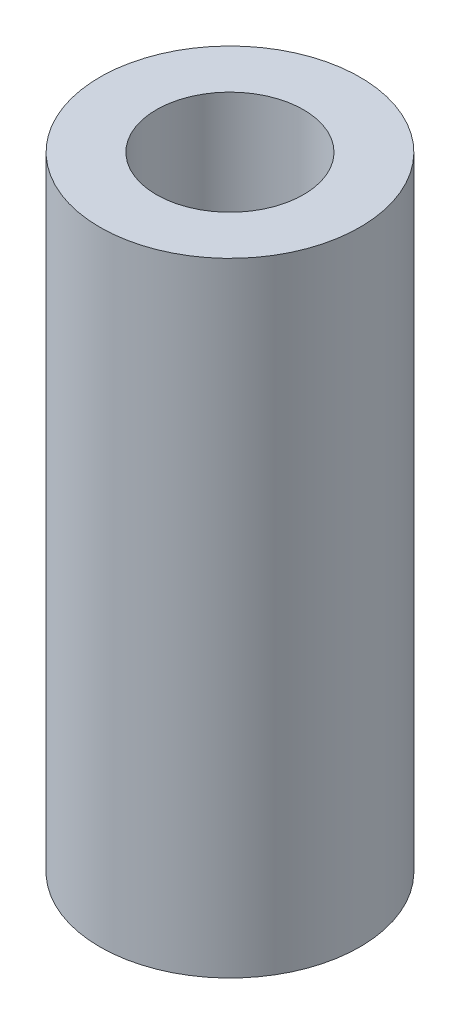
ISO-10303-21;
HEADER;
FILE_DESCRIPTION(('STEP AP214'),'2;1');
FILE_NAME('part.step','',(''),(''),'','','');
FILE_SCHEMA(('AUTOMOTIVE_DESIGN { 1 0 10303 214 1 1 1 1 }'));
ENDSEC;
DATA;
#1=APPLICATION_CONTEXT('core data for automotive mechanical design processes');
#2=APPLICATION_PROTOCOL_DEFINITION('international standard','automotive_design',2000,#1);
#3=PRODUCT_CONTEXT('',#1,'mechanical');
#4=PRODUCT('Part','Part','',(#3));
#5=PRODUCT_RELATED_PRODUCT_CATEGORY('part','',(#4));
#6=PRODUCT_DEFINITION_FORMATION('','',#4);
#7=PRODUCT_DEFINITION_CONTEXT('part definition',#1,'design');
#8=PRODUCT_DEFINITION('design','',#6,#7);
#9=PRODUCT_DEFINITION_SHAPE('','',#8);
#10=(LENGTH_UNIT() NAMED_UNIT(*) SI_UNIT(.MILLI.,.METRE.));
#11=(NAMED_UNIT(*) PLANE_ANGLE_UNIT() SI_UNIT($,.RADIAN.));
#12=(NAMED_UNIT(*) SI_UNIT($,.STERADIAN.) SOLID_ANGLE_UNIT());
#13=UNCERTAINTY_MEASURE_WITH_UNIT(LENGTH_MEASURE(1.E-05),#10,'distance_accuracy_value','');
#14=(GEOMETRIC_REPRESENTATION_CONTEXT(3) GLOBAL_UNCERTAINTY_ASSIGNED_CONTEXT((#13)) GLOBAL_UNIT_ASSIGNED_CONTEXT((#10,
#11,#12)) REPRESENTATION_CONTEXT('',''));
#15=CARTESIAN_POINT('',(0.,0.,0.));
#16=DIRECTION('',(0.,0.,1.));
#17=DIRECTION('',(1.,0.,0.));
#18=AXIS2_PLACEMENT_3D('',#15,#16,#17);
#19=CARTESIAN_POINT('',(0.,9.525,0.));
#20=DIRECTION('',(0.,-1.,0.));
#21=DIRECTION('',(0.,0.,-1.));
#22=AXIS2_PLACEMENT_3D('',#19,#20,#21);
#23=CYLINDRICAL_SURFACE('',#22,3.9751);
#24=CARTESIAN_POINT('',(0.,9.525,0.));
#25=DIRECTION('',(0.,1.,0.));
#26=DIRECTION('',(0.,0.,1.));
#27=AXIS2_PLACEMENT_3D('',#24,#25,#26);
#28=CIRCLE('',#27,3.9751);
#29=CARTESIAN_POINT('',(0.,9.525,3.9751));
#30=VERTEX_POINT('',#29);
#31=EDGE_CURVE('E10',#30,#30,#28,.T.);
#32=ORIENTED_EDGE('',*,*,#31,.F.);
#33=EDGE_LOOP('',(#32));
#34=FACE_BOUND('',#33,.T.);
#35=CARTESIAN_POINT('',(0.,-9.525,0.));
#36=DIRECTION('',(0.,1.,0.));
#37=DIRECTION('',(0.,0.,1.));
#38=AXIS2_PLACEMENT_3D('',#35,#36,#37);
#39=CIRCLE('',#38,3.9751);
#40=CARTESIAN_POINT('',(0.,-9.525,3.9751));
#41=VERTEX_POINT('',#40);
#42=EDGE_CURVE('E40',#41,#41,#39,.T.);
#43=ORIENTED_EDGE('',*,*,#42,.T.);
#44=EDGE_LOOP('',(#43));
#45=FACE_BOUND('',#44,.T.);
#46=ADVANCED_FACE('F37',(#34,#45),#23,.T.);
#47=CARTESIAN_POINT('',(0.,9.525,0.));
#48=DIRECTION('',(0.,1.,0.));
#49=DIRECTION('',(0.,0.,1.));
#50=AXIS2_PLACEMENT_3D('',#47,#48,#49);
#51=PLANE('',#50);
#52=CARTESIAN_POINT('',(0.,9.525,0.));
#53=DIRECTION('',(0.,1.,0.));
#54=DIRECTION('',(0.,0.,1.));
#55=AXIS2_PLACEMENT_3D('',#52,#53,#54);
#56=CIRCLE('',#55,2.24999999999999);
#57=CARTESIAN_POINT('',(0.,9.525,2.24999999999999));
#58=VERTEX_POINT('',#57);
#59=EDGE_CURVE('E51',#58,#58,#56,.T.);
#60=ORIENTED_EDGE('',*,*,#59,.F.);
#61=EDGE_LOOP('',(#60));
#62=FACE_BOUND('',#61,.T.);
#63=ORIENTED_EDGE('',*,*,#31,.T.);
#64=EDGE_LOOP('',(#63));
#65=FACE_BOUND('',#64,.T.);
#66=ADVANCED_FACE('F57',(#62,#65),#51,.T.);
#67=CARTESIAN_POINT('',(0.,-9.525,0.));
#68=DIRECTION('',(0.,1.,0.));
#69=DIRECTION('',(0.,0.,1.));
#70=AXIS2_PLACEMENT_3D('',#67,#68,#69);
#71=PLANE('',#70);
#72=CARTESIAN_POINT('',(0.,-9.525,0.));
#73=DIRECTION('',(0.,1.,0.));
#74=DIRECTION('',(0.,0.,1.));
#75=AXIS2_PLACEMENT_3D('',#72,#73,#74);
#76=CIRCLE('',#75,2.24999999999999);
#77=CARTESIAN_POINT('',(0.,-9.525,2.24999999999999));
#78=VERTEX_POINT('',#77);
#79=EDGE_CURVE('E47',#78,#78,#76,.T.);
#80=ORIENTED_EDGE('',*,*,#79,.T.);
#81=EDGE_LOOP('',(#80));
#82=FACE_BOUND('',#81,.T.);
#83=ORIENTED_EDGE('',*,*,#42,.F.);
#84=EDGE_LOOP('',(#83));
#85=FACE_BOUND('',#84,.T.);
#86=ADVANCED_FACE('F59',(#82,#85),#71,.F.);
#87=CARTESIAN_POINT('',(0.,9.525,0.));
#88=DIRECTION('',(0.,1.,0.));
#89=DIRECTION('',(0.,0.,1.));
#90=AXIS2_PLACEMENT_3D('',#87,#88,#89);
#91=CYLINDRICAL_SURFACE('',#90,2.24999999999999);
#92=ORIENTED_EDGE('',*,*,#79,.F.);
#93=EDGE_LOOP('',(#92));
#94=FACE_BOUND('',#93,.T.);
#95=ORIENTED_EDGE('',*,*,#59,.T.);
#96=EDGE_LOOP('',(#95));
#97=FACE_BOUND('',#96,.T.);
#98=ADVANCED_FACE('F55',(#94,#97),#91,.F.);
#99=CLOSED_SHELL('',(#46,#66,#86,#98));
#100=MANIFOLD_SOLID_BREP('B2',#99);
#101=ADVANCED_BREP_SHAPE_REPRESENTATION('',(#18,#100),#14);
#102=SHAPE_DEFINITION_REPRESENTATION(#9,#101);
ENDSEC;
END-ISO-10303-21;
